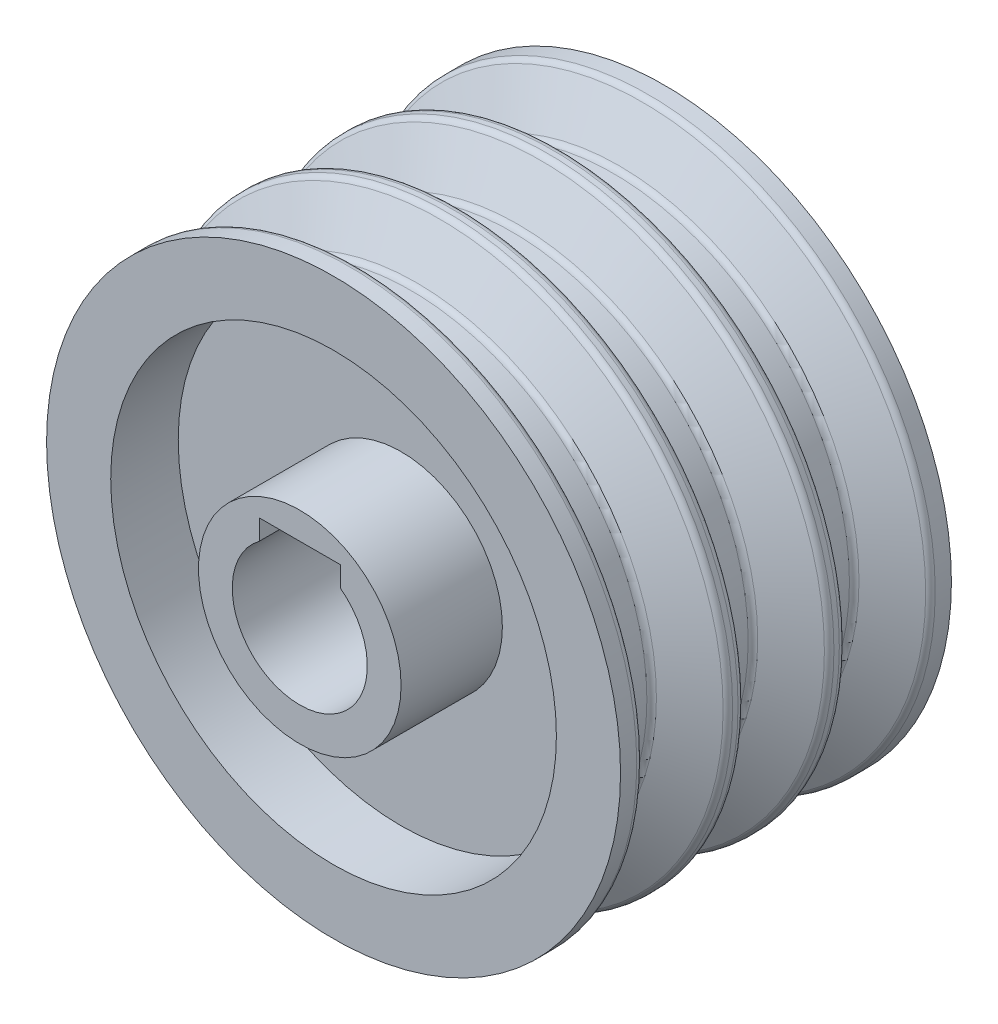
ISO-10303-21;
HEADER;
FILE_DESCRIPTION(('STEP AP214'),'2;1');
FILE_NAME('part.step','',(''),(''),'','','');
FILE_SCHEMA(('AUTOMOTIVE_DESIGN { 1 0 10303 214 1 1 1 1 }'));
ENDSEC;
DATA;
#1=APPLICATION_CONTEXT('core data for automotive mechanical design processes');
#2=APPLICATION_PROTOCOL_DEFINITION('international standard','automotive_design',2000,#1);
#3=PRODUCT_CONTEXT('',#1,'mechanical');
#4=PRODUCT('Part','Part','',(#3));
#5=PRODUCT_RELATED_PRODUCT_CATEGORY('part','',(#4));
#6=PRODUCT_DEFINITION_FORMATION('','',#4);
#7=PRODUCT_DEFINITION_CONTEXT('part definition',#1,'design');
#8=PRODUCT_DEFINITION('design','',#6,#7);
#9=PRODUCT_DEFINITION_SHAPE('','',#8);
#10=(LENGTH_UNIT() NAMED_UNIT(*) SI_UNIT(.MILLI.,.METRE.));
#11=(NAMED_UNIT(*) PLANE_ANGLE_UNIT() SI_UNIT($,.RADIAN.));
#12=(NAMED_UNIT(*) SI_UNIT($,.STERADIAN.) SOLID_ANGLE_UNIT());
#13=UNCERTAINTY_MEASURE_WITH_UNIT(LENGTH_MEASURE(1.E-05),#10,'distance_accuracy_value','');
#14=(GEOMETRIC_REPRESENTATION_CONTEXT(3) GLOBAL_UNCERTAINTY_ASSIGNED_CONTEXT((#13)) GLOBAL_UNIT_ASSIGNED_CONTEXT((#10,
#11,#12)) REPRESENTATION_CONTEXT('',''));
#15=CARTESIAN_POINT('',(0.,0.,0.));
#16=DIRECTION('',(0.,0.,1.));
#17=DIRECTION('',(1.,0.,0.));
#18=AXIS2_PLACEMENT_3D('',#15,#16,#17);
#19=CARTESIAN_POINT('',(0.,0.,24.5));
#20=DIRECTION('',(0.,0.,-1.));
#21=DIRECTION('',(-1.,0.,0.));
#22=AXIS2_PLACEMENT_3D('',#19,#20,#21);
#23=CYLINDRICAL_SURFACE('',#22,42.5);
#24=CARTESIAN_POINT('',(0.,0.,22.1));
#25=DIRECTION('',(0.,0.,-1.));
#26=DIRECTION('',(-1.,0.,0.));
#27=AXIS2_PLACEMENT_3D('',#24,#25,#26);
#28=CIRCLE('',#27,42.5);
#29=CARTESIAN_POINT('',(-42.5,0.,22.1));
#30=VERTEX_POINT('',#29);
#31=EDGE_CURVE('E202',#30,#30,#28,.F.);
#32=ORIENTED_EDGE('',*,*,#31,.T.);
#33=EDGE_LOOP('',(#32));
#34=FACE_BOUND('',#33,.T.);
#35=CARTESIAN_POINT('',(0.,0.,24.5));
#36=DIRECTION('',(0.,0.,1.));
#37=DIRECTION('',(1.,0.,0.));
#38=AXIS2_PLACEMENT_3D('',#35,#36,#37);
#39=CIRCLE('',#38,42.5);
#40=CARTESIAN_POINT('',(42.5,0.,24.5));
#41=VERTEX_POINT('',#40);
#42=EDGE_CURVE('E134',#41,#41,#39,.T.);
#43=ORIENTED_EDGE('',*,*,#42,.F.);
#44=EDGE_LOOP('',(#43));
#45=FACE_BOUND('',#44,.T.);
#46=ADVANCED_FACE('F35',(#34,#45),#23,.T.);
#47=CARTESIAN_POINT('',(0.,0.,-22.1000000000001));
#48=DIRECTION('',(0.,0.,-1.));
#49=DIRECTION('',(-1.,0.,0.));
#50=AXIS2_PLACEMENT_3D('',#47,#48,#49);
#51=CIRCLE('',#50,42.5);
#52=CARTESIAN_POINT('',(-42.5,0.,-22.1000000000001));
#53=VERTEX_POINT('',#52);
#54=EDGE_CURVE('E151',#53,#53,#51,.T.);
#55=ORIENTED_EDGE('',*,*,#54,.T.);
#56=EDGE_LOOP('',(#55));
#57=FACE_BOUND('',#56,.T.);
#58=CARTESIAN_POINT('',(0.,0.,-24.5));
#59=DIRECTION('',(0.,0.,1.));
#60=DIRECTION('',(1.,0.,0.));
#61=AXIS2_PLACEMENT_3D('',#58,#59,#60);
#62=CIRCLE('',#61,42.5);
#63=CARTESIAN_POINT('',(42.5,0.,-24.5));
#64=VERTEX_POINT('',#63);
#65=EDGE_CURVE('E135',#64,#64,#62,.T.);
#66=ORIENTED_EDGE('',*,*,#65,.T.);
#67=EDGE_LOOP('',(#66));
#68=FACE_BOUND('',#67,.T.);
#69=ADVANCED_FACE('F238',(#57,#68),#23,.T.);
#70=CARTESIAN_POINT('',(0.,0.,24.5));
#71=DIRECTION('',(0.,0.,-1.));
#72=DIRECTION('',(-1.,0.,0.));
#73=AXIS2_PLACEMENT_3D('',#70,#71,#72);
#74=CYLINDRICAL_SURFACE('',#73,33.);
#75=CARTESIAN_POINT('',(0.,0.,-24.5));
#76=DIRECTION('',(0.,0.,1.));
#77=DIRECTION('',(1.,0.,0.));
#78=AXIS2_PLACEMENT_3D('',#75,#76,#77);
#79=CIRCLE('',#78,33.);
#80=CARTESIAN_POINT('',(33.,0.,-24.5));
#81=VERTEX_POINT('',#80);
#82=EDGE_CURVE('E128',#81,#81,#79,.T.);
#83=ORIENTED_EDGE('',*,*,#82,.F.);
#84=EDGE_LOOP('',(#83));
#85=FACE_BOUND('',#84,.T.);
#86=CARTESIAN_POINT('',(0.,0.,-14.5));
#87=DIRECTION('',(0.,0.,1.));
#88=DIRECTION('',(1.,0.,0.));
#89=AXIS2_PLACEMENT_3D('',#86,#87,#88);
#90=CIRCLE('',#89,33.);
#91=CARTESIAN_POINT('',(33.,0.,-14.5));
#92=VERTEX_POINT('',#91);
#93=EDGE_CURVE('E124',#92,#92,#90,.T.);
#94=ORIENTED_EDGE('',*,*,#93,.T.);
#95=EDGE_LOOP('',(#94));
#96=FACE_BOUND('',#95,.T.);
#97=ADVANCED_FACE('F244',(#85,#96),#74,.F.);
#98=CARTESIAN_POINT('',(0.,0.,14.5));
#99=DIRECTION('',(0.,0.,1.));
#100=DIRECTION('',(1.,0.,0.));
#101=AXIS2_PLACEMENT_3D('',#98,#99,#100);
#102=CIRCLE('',#101,33.);
#103=CARTESIAN_POINT('',(33.,0.,14.5));
#104=VERTEX_POINT('',#103);
#105=EDGE_CURVE('E138',#104,#104,#102,.T.);
#106=ORIENTED_EDGE('',*,*,#105,.F.);
#107=EDGE_LOOP('',(#106));
#108=FACE_BOUND('',#107,.T.);
#109=CARTESIAN_POINT('',(0.,0.,24.5));
#110=DIRECTION('',(0.,0.,1.));
#111=DIRECTION('',(1.,0.,0.));
#112=AXIS2_PLACEMENT_3D('',#109,#110,#111);
#113=CIRCLE('',#112,33.);
#114=CARTESIAN_POINT('',(33.,0.,24.5));
#115=VERTEX_POINT('',#114);
#116=EDGE_CURVE('E131',#115,#115,#113,.T.);
#117=ORIENTED_EDGE('',*,*,#116,.T.);
#118=EDGE_LOOP('',(#117));
#119=FACE_BOUND('',#118,.T.);
#120=ADVANCED_FACE('F251',(#108,#119),#74,.F.);
#121=CARTESIAN_POINT('',(0.,0.,24.5));
#122=DIRECTION('',(0.,0.,1.));
#123=DIRECTION('',(1.,0.,0.));
#124=AXIS2_PLACEMENT_3D('',#121,#122,#123);
#125=PLANE('',#124);
#126=ORIENTED_EDGE('',*,*,#116,.F.);
#127=EDGE_LOOP('',(#126));
#128=FACE_BOUND('',#127,.T.);
#129=ORIENTED_EDGE('',*,*,#42,.T.);
#130=EDGE_LOOP('',(#129));
#131=FACE_BOUND('',#130,.T.);
#132=ADVANCED_FACE('F254',(#128,#131),#125,.T.);
#133=CARTESIAN_POINT('',(0.,0.,-24.5));
#134=DIRECTION('',(0.,0.,1.));
#135=DIRECTION('',(1.,0.,0.));
#136=AXIS2_PLACEMENT_3D('',#133,#134,#135);
#137=PLANE('',#136);
#138=ORIENTED_EDGE('',*,*,#82,.T.);
#139=EDGE_LOOP('',(#138));
#140=FACE_BOUND('',#139,.T.);
#141=ORIENTED_EDGE('',*,*,#65,.F.);
#142=EDGE_LOOP('',(#141));
#143=FACE_BOUND('',#142,.T.);
#144=ADVANCED_FACE('F249',(#140,#143),#137,.F.);
#145=CARTESIAN_POINT('',(0.,0.,14.5));
#146=DIRECTION('',(0.,0.,1.));
#147=DIRECTION('',(1.,0.,0.));
#148=AXIS2_PLACEMENT_3D('',#145,#146,#147);
#149=PLANE('',#148);
#150=CARTESIAN_POINT('',(0.,0.,14.5));
#151=DIRECTION('',(0.,0.,1.));
#152=DIRECTION('',(1.,0.,0.));
#153=AXIS2_PLACEMENT_3D('',#150,#151,#152);
#154=CIRCLE('',#153,15.);
#155=CARTESIAN_POINT('',(15.,0.,14.5));
#156=VERTEX_POINT('',#155);
#157=EDGE_CURVE('E125',#156,#156,#154,.T.);
#158=ORIENTED_EDGE('',*,*,#157,.F.);
#159=EDGE_LOOP('',(#158));
#160=FACE_BOUND('',#159,.T.);
#161=ORIENTED_EDGE('',*,*,#105,.T.);
#162=EDGE_LOOP('',(#161));
#163=FACE_BOUND('',#162,.T.);
#164=ADVANCED_FACE('F478',(#160,#163),#149,.T.);
#165=CARTESIAN_POINT('',(0.,0.,-14.5));
#166=DIRECTION('',(0.,0.,1.));
#167=DIRECTION('',(1.,0.,0.));
#168=AXIS2_PLACEMENT_3D('',#165,#166,#167);
#169=PLANE('',#168);
#170=CARTESIAN_POINT('',(0.,0.,-14.5));
#171=DIRECTION('',(0.,0.,1.));
#172=DIRECTION('',(1.,0.,0.));
#173=AXIS2_PLACEMENT_3D('',#170,#171,#172);
#174=CIRCLE('',#173,15.);
#175=CARTESIAN_POINT('',(15.,0.,-14.5));
#176=VERTEX_POINT('',#175);
#177=EDGE_CURVE('E121',#176,#176,#174,.F.);
#178=ORIENTED_EDGE('',*,*,#177,.F.);
#179=EDGE_LOOP('',(#178));
#180=FACE_BOUND('',#179,.T.);
#181=ORIENTED_EDGE('',*,*,#93,.F.);
#182=EDGE_LOOP('',(#181));
#183=FACE_BOUND('',#182,.T.);
#184=ADVANCED_FACE('F471',(#180,#183),#169,.F.);
#185=CARTESIAN_POINT('',(0.,0.,29.5));
#186=DIRECTION('',(0.,0.,-1.));
#187=DIRECTION('',(-1.,0.,0.));
#188=AXIS2_PLACEMENT_3D('',#185,#186,#187);
#189=CYLINDRICAL_SURFACE('',#188,15.);
#190=CARTESIAN_POINT('',(0.,0.,-29.5));
#191=DIRECTION('',(0.,0.,1.));
#192=DIRECTION('',(1.,0.,0.));
#193=AXIS2_PLACEMENT_3D('',#190,#191,#192);
#194=CIRCLE('',#193,15.);
#195=CARTESIAN_POINT('',(15.,0.,-29.5));
#196=VERTEX_POINT('',#195);
#197=EDGE_CURVE('E115',#196,#196,#194,.T.);
#198=ORIENTED_EDGE('',*,*,#197,.T.);
#199=EDGE_LOOP('',(#198));
#200=FACE_BOUND('',#199,.T.);
#201=ORIENTED_EDGE('',*,*,#177,.T.);
#202=EDGE_LOOP('',(#201));
#203=FACE_BOUND('',#202,.T.);
#204=ADVANCED_FACE('F477',(#200,#203),#189,.T.);
#205=CARTESIAN_POINT('',(6.,0.,29.5));
#206=DIRECTION('',(1.,0.,0.));
#207=DIRECTION('',(0.,1.,0.));
#208=AXIS2_PLACEMENT_3D('',#205,#206,#207);
#209=PLANE('',#208);
#210=DIRECTION('',(0.,-1.,0.));
#211=VECTOR('',#210,1.);
#212=CARTESIAN_POINT('',(6.,0.,-29.5));
#213=LINE('',#212,#211);
#214=CARTESIAN_POINT('',(5.99999999999992,11.,-29.5));
#215=VERTEX_POINT('',#214);
#216=CARTESIAN_POINT('',(5.99999999999994,8.,-29.5));
#217=VERTEX_POINT('',#216);
#218=EDGE_CURVE('E107',#215,#217,#213,.T.);
#219=ORIENTED_EDGE('',*,*,#218,.T.);
#220=DIRECTION('',(0.,0.,-1.));
#221=VECTOR('',#220,1.);
#222=CARTESIAN_POINT('',(5.99999999999994,8.,29.5));
#223=LINE('',#222,#221);
#224=CARTESIAN_POINT('',(5.99999999999994,8.,29.5));
#225=VERTEX_POINT('',#224);
#226=EDGE_CURVE('E91',#225,#217,#223,.T.);
#227=ORIENTED_EDGE('',*,*,#226,.F.);
#228=DIRECTION('',(0.,-1.,0.));
#229=VECTOR('',#228,1.);
#230=CARTESIAN_POINT('',(6.,0.,29.5));
#231=LINE('',#230,#229);
#232=CARTESIAN_POINT('',(5.99999999999992,11.,29.5));
#233=VERTEX_POINT('',#232);
#234=EDGE_CURVE('E77',#233,#225,#231,.T.);
#235=ORIENTED_EDGE('',*,*,#234,.F.);
#236=DIRECTION('',(0.,0.,-1.));
#237=VECTOR('',#236,1.);
#238=CARTESIAN_POINT('',(5.99999999999992,11.,29.5));
#239=LINE('',#238,#237);
#240=EDGE_CURVE('E52',#233,#215,#239,.T.);
#241=ORIENTED_EDGE('',*,*,#240,.T.);
#242=EDGE_LOOP('',(#219,#227,#235,#241));
#243=FACE_BOUND('',#242,.T.);
#244=ADVANCED_FACE('F495',(#243),#209,.F.);
#245=CARTESIAN_POINT('',(0.,0.,29.5));
#246=DIRECTION('',(0.,0.,-1.));
#247=DIRECTION('',(-1.,0.,0.));
#248=AXIS2_PLACEMENT_3D('',#245,#246,#247);
#249=CYLINDRICAL_SURFACE('',#248,9.99999999999998);
#250=CARTESIAN_POINT('',(0.,0.,-29.5));
#251=DIRECTION('',(0.,0.,1.));
#252=DIRECTION('',(1.,0.,0.));
#253=AXIS2_PLACEMENT_3D('',#250,#251,#252);
#254=CIRCLE('',#253,9.99999999999998);
#255=CARTESIAN_POINT('',(-6.,8.,-29.5));
#256=VERTEX_POINT('',#255);
#257=EDGE_CURVE('E87',#256,#217,#254,.T.);
#258=ORIENTED_EDGE('',*,*,#257,.F.);
#259=DIRECTION('',(0.,0.,-1.));
#260=VECTOR('',#259,1.);
#261=CARTESIAN_POINT('',(-6.,8.,29.5));
#262=LINE('',#261,#260);
#263=CARTESIAN_POINT('',(-6.,8.,29.5));
#264=VERTEX_POINT('',#263);
#265=EDGE_CURVE('E83',#264,#256,#262,.T.);
#266=ORIENTED_EDGE('',*,*,#265,.F.);
#267=CARTESIAN_POINT('',(0.,0.,29.5));
#268=DIRECTION('',(0.,0.,1.));
#269=DIRECTION('',(1.,0.,0.));
#270=AXIS2_PLACEMENT_3D('',#267,#268,#269);
#271=CIRCLE('',#270,9.99999999999998);
#272=EDGE_CURVE('E85',#264,#225,#271,.T.);
#273=ORIENTED_EDGE('',*,*,#272,.T.);
#274=ORIENTED_EDGE('',*,*,#226,.T.);
#275=EDGE_LOOP('',(#258,#266,#273,#274));
#276=FACE_BOUND('',#275,.T.);
#277=ADVANCED_FACE('F84',(#276),#249,.F.);
#278=CARTESIAN_POINT('',(-6.,0.,29.5));
#279=DIRECTION('',(1.,0.,0.));
#280=DIRECTION('',(0.,0.,-1.));
#281=AXIS2_PLACEMENT_3D('',#278,#279,#280);
#282=PLANE('',#281);
#283=DIRECTION('',(0.,-1.,0.));
#284=VECTOR('',#283,1.);
#285=CARTESIAN_POINT('',(-6.,0.,-29.5));
#286=LINE('',#285,#284);
#287=CARTESIAN_POINT('',(-6.,11.,-29.5));
#288=VERTEX_POINT('',#287);
#289=EDGE_CURVE('E110',#288,#256,#286,.T.);
#290=ORIENTED_EDGE('',*,*,#289,.F.);
#291=DIRECTION('',(0.,0.,-1.));
#292=VECTOR('',#291,1.);
#293=CARTESIAN_POINT('',(-6.,11.,29.5));
#294=LINE('',#293,#292);
#295=CARTESIAN_POINT('',(-6.,11.,29.5));
#296=VERTEX_POINT('',#295);
#297=EDGE_CURVE('E66',#296,#288,#294,.T.);
#298=ORIENTED_EDGE('',*,*,#297,.F.);
#299=DIRECTION('',(0.,-1.,0.));
#300=VECTOR('',#299,1.);
#301=CARTESIAN_POINT('',(-6.,0.,29.5));
#302=LINE('',#301,#300);
#303=EDGE_CURVE('E96',#296,#264,#302,.T.);
#304=ORIENTED_EDGE('',*,*,#303,.T.);
#305=ORIENTED_EDGE('',*,*,#265,.T.);
#306=EDGE_LOOP('',(#290,#298,#304,#305));
#307=FACE_BOUND('',#306,.T.);
#308=ADVANCED_FACE('F98',(#307),#282,.T.);
#309=CARTESIAN_POINT('',(0.,11.,29.5));
#310=DIRECTION('',(0.,-1.,0.));
#311=DIRECTION('',(0.,0.,-1.));
#312=AXIS2_PLACEMENT_3D('',#309,#310,#311);
#313=PLANE('',#312);
#314=DIRECTION('',(-1.,0.,0.));
#315=VECTOR('',#314,1.);
#316=CARTESIAN_POINT('',(0.,11.,-29.5));
#317=LINE('',#316,#315);
#318=EDGE_CURVE('E112',#215,#288,#317,.T.);
#319=ORIENTED_EDGE('',*,*,#318,.F.);
#320=ORIENTED_EDGE('',*,*,#240,.F.);
#321=DIRECTION('',(-1.,0.,0.));
#322=VECTOR('',#321,1.);
#323=CARTESIAN_POINT('',(0.,11.,29.5));
#324=LINE('',#323,#322);
#325=EDGE_CURVE('E99',#233,#296,#324,.T.);
#326=ORIENTED_EDGE('',*,*,#325,.T.);
#327=ORIENTED_EDGE('',*,*,#297,.T.);
#328=EDGE_LOOP('',(#319,#320,#326,#327));
#329=FACE_BOUND('',#328,.T.);
#330=ADVANCED_FACE('F523',(#329),#313,.T.);
#331=ORIENTED_EDGE('',*,*,#157,.T.);
#332=EDGE_LOOP('',(#331));
#333=FACE_BOUND('',#332,.T.);
#334=CARTESIAN_POINT('',(0.,0.,29.5));
#335=DIRECTION('',(0.,0.,1.));
#336=DIRECTION('',(1.,0.,0.));
#337=AXIS2_PLACEMENT_3D('',#334,#335,#336);
#338=CIRCLE('',#337,15.);
#339=CARTESIAN_POINT('',(15.,0.,29.5));
#340=VERTEX_POINT('',#339);
#341=EDGE_CURVE('E101',#340,#340,#338,.T.);
#342=ORIENTED_EDGE('',*,*,#341,.F.);
#343=EDGE_LOOP('',(#342));
#344=FACE_BOUND('',#343,.T.);
#345=ADVANCED_FACE('F498',(#333,#344),#189,.T.);
#346=CARTESIAN_POINT('',(0.,0.,29.5));
#347=DIRECTION('',(0.,0.,1.));
#348=DIRECTION('',(1.,0.,0.));
#349=AXIS2_PLACEMENT_3D('',#346,#347,#348);
#350=PLANE('',#349);
#351=ORIENTED_EDGE('',*,*,#234,.T.);
#352=ORIENTED_EDGE('',*,*,#272,.F.);
#353=ORIENTED_EDGE('',*,*,#303,.F.);
#354=ORIENTED_EDGE('',*,*,#325,.F.);
#355=EDGE_LOOP('',(#351,#352,#353,#354));
#356=FACE_BOUND('',#355,.T.);
#357=ORIENTED_EDGE('',*,*,#341,.T.);
#358=EDGE_LOOP('',(#357));
#359=FACE_BOUND('',#358,.T.);
#360=ADVANCED_FACE('F94',(#356,#359),#350,.T.);
#361=CARTESIAN_POINT('',(0.,0.,-29.5));
#362=DIRECTION('',(0.,0.,1.));
#363=DIRECTION('',(1.,0.,0.));
#364=AXIS2_PLACEMENT_3D('',#361,#362,#363);
#365=PLANE('',#364);
#366=ORIENTED_EDGE('',*,*,#218,.F.);
#367=ORIENTED_EDGE('',*,*,#318,.T.);
#368=ORIENTED_EDGE('',*,*,#289,.T.);
#369=ORIENTED_EDGE('',*,*,#257,.T.);
#370=EDGE_LOOP('',(#366,#367,#368,#369));
#371=FACE_BOUND('',#370,.T.);
#372=ORIENTED_EDGE('',*,*,#197,.F.);
#373=EDGE_LOOP('',(#372));
#374=FACE_BOUND('',#373,.T.);
#375=ADVANCED_FACE('F446',(#371,#374),#365,.F.);
#376=CARTESIAN_POINT('',(0.,0.,-8.49999999999995));
#377=DIRECTION('',(0.,0.,1.));
#378=DIRECTION('',(1.,0.,0.));
#379=AXIS2_PLACEMENT_3D('',#376,#377,#378);
#380=CONICAL_SURFACE('',#379,42.5,1.08083900054117);
#381=CARTESIAN_POINT('',(0.,0.,-12.2176470588235));
#382=DIRECTION('',(0.,0.,1.));
#383=DIRECTION('',(1.,0.,0.));
#384=AXIS2_PLACEMENT_3D('',#381,#382,#383);
#385=CIRCLE('',#384,35.5294117647059);
#386=CARTESIAN_POINT('',(35.5294117647059,0.,-12.2176470588235));
#387=VERTEX_POINT('',#386);
#388=EDGE_CURVE('E163',#387,#387,#385,.T.);
#389=ORIENTED_EDGE('',*,*,#388,.T.);
#390=EDGE_LOOP('',(#389));
#391=FACE_BOUND('',#390,.T.);
#392=CARTESIAN_POINT('',(0.,0.,-8.78235294117641));
#393=DIRECTION('',(0.,0.,1.));
#394=DIRECTION('',(1.,0.,0.));
#395=AXIS2_PLACEMENT_3D('',#392,#393,#394);
#396=CIRCLE('',#395,41.9705882352941);
#397=CARTESIAN_POINT('',(41.9705882352941,0.,-8.78235294117641));
#398=VERTEX_POINT('',#397);
#399=EDGE_CURVE('E160',#398,#398,#396,.F.);
#400=ORIENTED_EDGE('',*,*,#399,.T.);
#401=EDGE_LOOP('',(#400));
#402=FACE_BOUND('',#401,.T.);
#403=ADVANCED_FACE('F437',(#391,#402),#380,.T.);
#404=CARTESIAN_POINT('',(0.,0.,1000.));
#405=DIRECTION('',(0.,0.,1.));
#406=DIRECTION('',(1.,0.,0.));
#407=AXIS2_PLACEMENT_3D('',#404,#405,#406);
#408=CYLINDRICAL_SURFACE('',#407,35.);
#409=CARTESIAN_POINT('',(0.,0.,-16.9000000000001));
#410=DIRECTION('',(0.,0.,1.));
#411=DIRECTION('',(1.,0.,0.));
#412=AXIS2_PLACEMENT_3D('',#409,#410,#411);
#413=CIRCLE('',#412,35.);
#414=CARTESIAN_POINT('',(35.,0.,-16.9000000000001));
#415=VERTEX_POINT('',#414);
#416=EDGE_CURVE('E157',#415,#415,#413,.T.);
#417=ORIENTED_EDGE('',*,*,#416,.T.);
#418=EDGE_LOOP('',(#417));
#419=FACE_BOUND('',#418,.T.);
#420=CARTESIAN_POINT('',(0.,0.,-13.0999999999999));
#421=DIRECTION('',(0.,0.,1.));
#422=DIRECTION('',(1.,0.,0.));
#423=AXIS2_PLACEMENT_3D('',#420,#421,#422);
#424=CIRCLE('',#423,35.);
#425=CARTESIAN_POINT('',(35.,0.,-13.0999999999999));
#426=VERTEX_POINT('',#425);
#427=EDGE_CURVE('E154',#426,#426,#424,.F.);
#428=ORIENTED_EDGE('',*,*,#427,.T.);
#429=EDGE_LOOP('',(#428));
#430=FACE_BOUND('',#429,.T.);
#431=ADVANCED_FACE('F428',(#419,#430),#408,.T.);
#432=CARTESIAN_POINT('',(0.,0.,-17.5000000000001));
#433=DIRECTION('',(0.,0.,-1.));
#434=DIRECTION('',(-1.,0.,0.));
#435=AXIS2_PLACEMENT_3D('',#432,#433,#434);
#436=CONICAL_SURFACE('',#435,35.,1.08083900054117);
#437=CARTESIAN_POINT('',(0.,0.,-21.2176470588236));
#438=DIRECTION('',(0.,0.,-1.));
#439=DIRECTION('',(-1.,0.,0.));
#440=AXIS2_PLACEMENT_3D('',#437,#438,#439);
#441=CIRCLE('',#440,41.9705882352941);
#442=CARTESIAN_POINT('',(-41.9705882352941,0.,-21.2176470588236));
#443=VERTEX_POINT('',#442);
#444=EDGE_CURVE('E148',#443,#443,#441,.F.);
#445=ORIENTED_EDGE('',*,*,#444,.T.);
#446=EDGE_LOOP('',(#445));
#447=FACE_BOUND('',#446,.T.);
#448=CARTESIAN_POINT('',(0.,0.,-17.7823529411766));
#449=DIRECTION('',(0.,0.,-1.));
#450=DIRECTION('',(-1.,0.,0.));
#451=AXIS2_PLACEMENT_3D('',#448,#449,#450);
#452=CIRCLE('',#451,35.5294117647059);
#453=CARTESIAN_POINT('',(-35.5294117647059,0.,-17.7823529411766));
#454=VERTEX_POINT('',#453);
#455=EDGE_CURVE('E145',#454,#454,#452,.T.);
#456=ORIENTED_EDGE('',*,*,#455,.T.);
#457=EDGE_LOOP('',(#456));
#458=FACE_BOUND('',#457,.T.);
#459=ADVANCED_FACE('F422',(#447,#458),#436,.T.);
#460=CARTESIAN_POINT('',(0.,0.,-7.89999999999996));
#461=DIRECTION('',(0.,0.,-1.));
#462=DIRECTION('',(-1.,0.,0.));
#463=AXIS2_PLACEMENT_3D('',#460,#461,#462);
#464=CIRCLE('',#463,42.5);
#465=CARTESIAN_POINT('',(-42.5,0.,-7.89999999999996));
#466=VERTEX_POINT('',#465);
#467=EDGE_CURVE('E169',#466,#466,#464,.F.);
#468=ORIENTED_EDGE('',*,*,#467,.T.);
#469=EDGE_LOOP('',(#468));
#470=FACE_BOUND('',#469,.T.);
#471=CARTESIAN_POINT('',(0.,0.,-7.09999999999995));
#472=DIRECTION('',(0.,0.,-1.));
#473=DIRECTION('',(-1.,0.,0.));
#474=AXIS2_PLACEMENT_3D('',#471,#472,#473);
#475=CIRCLE('',#474,42.5);
#476=CARTESIAN_POINT('',(-42.5,0.,-7.09999999999995));
#477=VERTEX_POINT('',#476);
#478=EDGE_CURVE('E166',#477,#477,#475,.T.);
#479=ORIENTED_EDGE('',*,*,#478,.T.);
#480=EDGE_LOOP('',(#479));
#481=FACE_BOUND('',#480,.T.);
#482=ADVANCED_FACE('F235',(#470,#481),#23,.T.);
#483=CARTESIAN_POINT('',(0.,0.,6.49999999999995));
#484=DIRECTION('',(0.,0.,1.));
#485=DIRECTION('',(1.,0.,0.));
#486=AXIS2_PLACEMENT_3D('',#483,#484,#485);
#487=CONICAL_SURFACE('',#486,42.5,1.08083900054117);
#488=CARTESIAN_POINT('',(0.,0.,2.78235294117642));
#489=DIRECTION('',(0.,0.,1.));
#490=DIRECTION('',(1.,0.,0.));
#491=AXIS2_PLACEMENT_3D('',#488,#489,#490);
#492=CIRCLE('',#491,35.5294117647059);
#493=CARTESIAN_POINT('',(35.5294117647059,0.,2.78235294117642));
#494=VERTEX_POINT('',#493);
#495=EDGE_CURVE('E187',#494,#494,#492,.T.);
#496=ORIENTED_EDGE('',*,*,#495,.T.);
#497=EDGE_LOOP('',(#496));
#498=FACE_BOUND('',#497,.T.);
#499=CARTESIAN_POINT('',(0.,0.,6.21764705882349));
#500=DIRECTION('',(0.,0.,1.));
#501=DIRECTION('',(1.,0.,0.));
#502=AXIS2_PLACEMENT_3D('',#499,#500,#501);
#503=CIRCLE('',#502,41.9705882352941);
#504=CARTESIAN_POINT('',(41.9705882352941,0.,6.21764705882349));
#505=VERTEX_POINT('',#504);
#506=EDGE_CURVE('E184',#505,#505,#503,.F.);
#507=ORIENTED_EDGE('',*,*,#506,.T.);
#508=EDGE_LOOP('',(#507));
#509=FACE_BOUND('',#508,.T.);
#510=ADVANCED_FACE('F409',(#498,#509),#487,.T.);
#511=CARTESIAN_POINT('',(0.,0.,1000.));
#512=DIRECTION('',(0.,0.,1.));
#513=DIRECTION('',(1.,0.,0.));
#514=AXIS2_PLACEMENT_3D('',#511,#512,#513);
#515=CYLINDRICAL_SURFACE('',#514,35.);
#516=CARTESIAN_POINT('',(0.,0.,-1.90000000000001));
#517=DIRECTION('',(0.,0.,1.));
#518=DIRECTION('',(1.,0.,0.));
#519=AXIS2_PLACEMENT_3D('',#516,#517,#518);
#520=CIRCLE('',#519,35.);
#521=CARTESIAN_POINT('',(35.,0.,-1.90000000000001));
#522=VERTEX_POINT('',#521);
#523=EDGE_CURVE('E181',#522,#522,#520,.T.);
#524=ORIENTED_EDGE('',*,*,#523,.T.);
#525=EDGE_LOOP('',(#524));
#526=FACE_BOUND('',#525,.T.);
#527=CARTESIAN_POINT('',(0.,0.,1.8999999999999));
#528=DIRECTION('',(0.,0.,1.));
#529=DIRECTION('',(1.,0.,0.));
#530=AXIS2_PLACEMENT_3D('',#527,#528,#529);
#531=CIRCLE('',#530,35.);
#532=CARTESIAN_POINT('',(35.,0.,1.8999999999999));
#533=VERTEX_POINT('',#532);
#534=EDGE_CURVE('E178',#533,#533,#531,.F.);
#535=ORIENTED_EDGE('',*,*,#534,.T.);
#536=EDGE_LOOP('',(#535));
#537=FACE_BOUND('',#536,.T.);
#538=ADVANCED_FACE('F401',(#526,#537),#515,.T.);
#539=CARTESIAN_POINT('',(0.,0.,-2.49999999999995));
#540=DIRECTION('',(0.,0.,-1.));
#541=DIRECTION('',(-1.,0.,0.));
#542=AXIS2_PLACEMENT_3D('',#539,#540,#541);
#543=CONICAL_SURFACE('',#542,35.,1.08083900054117);
#544=CARTESIAN_POINT('',(0.,0.,-6.21764705882348));
#545=DIRECTION('',(0.,0.,-1.));
#546=DIRECTION('',(-1.,0.,0.));
#547=AXIS2_PLACEMENT_3D('',#544,#545,#546);
#548=CIRCLE('',#547,41.9705882352941);
#549=CARTESIAN_POINT('',(-41.9705882352941,0.,-6.21764705882348));
#550=VERTEX_POINT('',#549);
#551=EDGE_CURVE('E175',#550,#550,#548,.F.);
#552=ORIENTED_EDGE('',*,*,#551,.T.);
#553=EDGE_LOOP('',(#552));
#554=FACE_BOUND('',#553,.T.);
#555=CARTESIAN_POINT('',(0.,0.,-2.78235294117644));
#556=DIRECTION('',(0.,0.,-1.));
#557=DIRECTION('',(-1.,0.,0.));
#558=AXIS2_PLACEMENT_3D('',#555,#556,#557);
#559=CIRCLE('',#558,35.5294117647059);
#560=CARTESIAN_POINT('',(-35.5294117647059,0.,-2.78235294117644));
#561=VERTEX_POINT('',#560);
#562=EDGE_CURVE('E172',#561,#561,#559,.T.);
#563=ORIENTED_EDGE('',*,*,#562,.T.);
#564=EDGE_LOOP('',(#563));
#565=FACE_BOUND('',#564,.T.);
#566=ADVANCED_FACE('F232',(#554,#565),#543,.T.);
#567=CARTESIAN_POINT('',(0.,0.,7.09999999999995));
#568=DIRECTION('',(0.,0.,-1.));
#569=DIRECTION('',(-1.,0.,0.));
#570=AXIS2_PLACEMENT_3D('',#567,#568,#569);
#571=CIRCLE('',#570,42.5);
#572=CARTESIAN_POINT('',(-42.5,0.,7.09999999999995));
#573=VERTEX_POINT('',#572);
#574=EDGE_CURVE('E193',#573,#573,#571,.F.);
#575=ORIENTED_EDGE('',*,*,#574,.T.);
#576=EDGE_LOOP('',(#575));
#577=FACE_BOUND('',#576,.T.);
#578=CARTESIAN_POINT('',(0.,0.,7.89999999999995));
#579=DIRECTION('',(0.,0.,-1.));
#580=DIRECTION('',(-1.,0.,0.));
#581=AXIS2_PLACEMENT_3D('',#578,#579,#580);
#582=CIRCLE('',#581,42.5);
#583=CARTESIAN_POINT('',(-42.5,0.,7.89999999999995));
#584=VERTEX_POINT('',#583);
#585=EDGE_CURVE('E190',#584,#584,#582,.T.);
#586=ORIENTED_EDGE('',*,*,#585,.T.);
#587=EDGE_LOOP('',(#586));
#588=FACE_BOUND('',#587,.T.);
#589=ADVANCED_FACE('F222',(#577,#588),#23,.T.);
#590=CARTESIAN_POINT('',(0.,0.,21.5));
#591=DIRECTION('',(0.,0.,1.));
#592=DIRECTION('',(1.,0.,0.));
#593=AXIS2_PLACEMENT_3D('',#590,#591,#592);
#594=CONICAL_SURFACE('',#593,42.5,1.08083900054117);
#595=CARTESIAN_POINT('',(0.,0.,21.2176470588235));
#596=DIRECTION('',(0.,0.,1.));
#597=DIRECTION('',(1.,0.,0.));
#598=AXIS2_PLACEMENT_3D('',#595,#596,#597);
#599=CIRCLE('',#598,41.9705882352941);
#600=CARTESIAN_POINT('',(41.9705882352941,0.,21.2176470588235));
#601=VERTEX_POINT('',#600);
#602=EDGE_CURVE('E208',#601,#601,#599,.F.);
#603=ORIENTED_EDGE('',*,*,#602,.T.);
#604=EDGE_LOOP('',(#603));
#605=FACE_BOUND('',#604,.T.);
#606=CARTESIAN_POINT('',(0.,0.,17.7823529411764));
#607=DIRECTION('',(0.,0.,1.));
#608=DIRECTION('',(1.,0.,0.));
#609=AXIS2_PLACEMENT_3D('',#606,#607,#608);
#610=CIRCLE('',#609,35.5294117647059);
#611=CARTESIAN_POINT('',(35.5294117647059,0.,17.7823529411764));
#612=VERTEX_POINT('',#611);
#613=EDGE_CURVE('E205',#612,#612,#610,.T.);
#614=ORIENTED_EDGE('',*,*,#613,.T.);
#615=EDGE_LOOP('',(#614));
#616=FACE_BOUND('',#615,.T.);
#617=ADVANCED_FACE('F220',(#605,#616),#594,.T.);
#618=CARTESIAN_POINT('',(0.,0.,1000.));
#619=DIRECTION('',(0.,0.,1.));
#620=DIRECTION('',(1.,0.,0.));
#621=AXIS2_PLACEMENT_3D('',#618,#619,#620);
#622=CYLINDRICAL_SURFACE('',#621,35.);
#623=CARTESIAN_POINT('',(0.,0.,13.1));
#624=DIRECTION('',(0.,0.,1.));
#625=DIRECTION('',(1.,0.,0.));
#626=AXIS2_PLACEMENT_3D('',#623,#624,#625);
#627=CIRCLE('',#626,35.);
#628=CARTESIAN_POINT('',(35.,0.,13.1));
#629=VERTEX_POINT('',#628);
#630=EDGE_CURVE('E11',#629,#629,#627,.T.);
#631=ORIENTED_EDGE('',*,*,#630,.T.);
#632=EDGE_LOOP('',(#631));
#633=FACE_BOUND('',#632,.T.);
#634=CARTESIAN_POINT('',(0.,0.,16.8999999999999));
#635=DIRECTION('',(0.,0.,1.));
#636=DIRECTION('',(1.,0.,0.));
#637=AXIS2_PLACEMENT_3D('',#634,#635,#636);
#638=CIRCLE('',#637,35.);
#639=CARTESIAN_POINT('',(35.,0.,16.8999999999999));
#640=VERTEX_POINT('',#639);
#641=EDGE_CURVE('E44',#640,#640,#638,.F.);
#642=ORIENTED_EDGE('',*,*,#641,.T.);
#643=EDGE_LOOP('',(#642));
#644=FACE_BOUND('',#643,.T.);
#645=ADVANCED_FACE('F213',(#633,#644),#622,.T.);
#646=CARTESIAN_POINT('',(0.,0.,12.5));
#647=DIRECTION('',(0.,0.,-1.));
#648=DIRECTION('',(-1.,0.,0.));
#649=AXIS2_PLACEMENT_3D('',#646,#647,#648);
#650=CONICAL_SURFACE('',#649,35.,1.08083900054117);
#651=CARTESIAN_POINT('',(0.,0.,8.78235294117641));
#652=DIRECTION('',(0.,0.,-1.));
#653=DIRECTION('',(-1.,0.,0.));
#654=AXIS2_PLACEMENT_3D('',#651,#652,#653);
#655=CIRCLE('',#654,41.9705882352941);
#656=CARTESIAN_POINT('',(-41.9705882352941,0.,8.78235294117641));
#657=VERTEX_POINT('',#656);
#658=EDGE_CURVE('E199',#657,#657,#655,.F.);
#659=ORIENTED_EDGE('',*,*,#658,.T.);
#660=EDGE_LOOP('',(#659));
#661=FACE_BOUND('',#660,.T.);
#662=CARTESIAN_POINT('',(0.,0.,12.2176470588235));
#663=DIRECTION('',(0.,0.,-1.));
#664=DIRECTION('',(-1.,0.,0.));
#665=AXIS2_PLACEMENT_3D('',#662,#663,#664);
#666=CIRCLE('',#665,35.5294117647059);
#667=CARTESIAN_POINT('',(-35.5294117647059,0.,12.2176470588235));
#668=VERTEX_POINT('',#667);
#669=EDGE_CURVE('E196',#668,#668,#666,.T.);
#670=ORIENTED_EDGE('',*,*,#669,.T.);
#671=EDGE_LOOP('',(#670));
#672=FACE_BOUND('',#671,.T.);
#673=ADVANCED_FACE('F229',(#661,#672),#650,.T.);
#674=CARTESIAN_POINT('',(0.,0.,-22.1000000000001));
#675=DIRECTION('',(0.,0.,-1.));
#676=DIRECTION('',(-1.,0.,0.));
#677=AXIS2_PLACEMENT_3D('',#674,#675,#676);
#678=TOROIDAL_SURFACE('',#677,41.5,1.);
#679=ORIENTED_EDGE('',*,*,#54,.F.);
#680=EDGE_LOOP('',(#679));
#681=FACE_BOUND('',#680,.T.);
#682=ORIENTED_EDGE('',*,*,#444,.F.);
#683=EDGE_LOOP('',(#682));
#684=FACE_BOUND('',#683,.T.);
#685=ADVANCED_FACE('F256',(#681,#684),#678,.T.);
#686=CARTESIAN_POINT('',(0.,0.,-16.9000000000001));
#687=DIRECTION('',(0.,0.,1.));
#688=DIRECTION('',(1.,0.,0.));
#689=AXIS2_PLACEMENT_3D('',#686,#687,#688);
#690=TOROIDAL_SURFACE('',#689,36.,1.);
#691=ORIENTED_EDGE('',*,*,#455,.F.);
#692=EDGE_LOOP('',(#691));
#693=FACE_BOUND('',#692,.T.);
#694=ORIENTED_EDGE('',*,*,#416,.F.);
#695=EDGE_LOOP('',(#694));
#696=FACE_BOUND('',#695,.T.);
#697=ADVANCED_FACE('F259',(#693,#696),#690,.F.);
#698=CARTESIAN_POINT('',(0.,0.,-13.0999999999999));
#699=DIRECTION('',(0.,0.,1.));
#700=DIRECTION('',(1.,0.,0.));
#701=AXIS2_PLACEMENT_3D('',#698,#699,#700);
#702=TOROIDAL_SURFACE('',#701,36.,1.);
#703=ORIENTED_EDGE('',*,*,#427,.F.);
#704=EDGE_LOOP('',(#703));
#705=FACE_BOUND('',#704,.T.);
#706=ORIENTED_EDGE('',*,*,#388,.F.);
#707=EDGE_LOOP('',(#706));
#708=FACE_BOUND('',#707,.T.);
#709=ADVANCED_FACE('F263',(#705,#708),#702,.F.);
#710=CARTESIAN_POINT('',(0.,0.,-7.89999999999995));
#711=DIRECTION('',(0.,0.,-1.));
#712=DIRECTION('',(-1.,0.,0.));
#713=AXIS2_PLACEMENT_3D('',#710,#711,#712);
#714=TOROIDAL_SURFACE('',#713,41.5,1.);
#715=ORIENTED_EDGE('',*,*,#399,.F.);
#716=EDGE_LOOP('',(#715));
#717=FACE_BOUND('',#716,.T.);
#718=ORIENTED_EDGE('',*,*,#467,.F.);
#719=EDGE_LOOP('',(#718));
#720=FACE_BOUND('',#719,.T.);
#721=ADVANCED_FACE('F267',(#717,#720),#714,.T.);
#722=CARTESIAN_POINT('',(0.,0.,-7.09999999999995));
#723=DIRECTION('',(0.,0.,-1.));
#724=DIRECTION('',(-1.,0.,0.));
#725=AXIS2_PLACEMENT_3D('',#722,#723,#724);
#726=TOROIDAL_SURFACE('',#725,41.5,1.);
#727=ORIENTED_EDGE('',*,*,#478,.F.);
#728=EDGE_LOOP('',(#727));
#729=FACE_BOUND('',#728,.T.);
#730=ORIENTED_EDGE('',*,*,#551,.F.);
#731=EDGE_LOOP('',(#730));
#732=FACE_BOUND('',#731,.T.);
#733=ADVANCED_FACE('F271',(#729,#732),#726,.T.);
#734=CARTESIAN_POINT('',(0.,0.,-1.90000000000001));
#735=DIRECTION('',(0.,0.,1.));
#736=DIRECTION('',(1.,0.,0.));
#737=AXIS2_PLACEMENT_3D('',#734,#735,#736);
#738=TOROIDAL_SURFACE('',#737,36.,1.);
#739=ORIENTED_EDGE('',*,*,#562,.F.);
#740=EDGE_LOOP('',(#739));
#741=FACE_BOUND('',#740,.T.);
#742=ORIENTED_EDGE('',*,*,#523,.F.);
#743=EDGE_LOOP('',(#742));
#744=FACE_BOUND('',#743,.T.);
#745=ADVANCED_FACE('F275',(#741,#744),#738,.F.);
#746=CARTESIAN_POINT('',(0.,0.,1.8999999999999));
#747=DIRECTION('',(0.,0.,1.));
#748=DIRECTION('',(1.,0.,0.));
#749=AXIS2_PLACEMENT_3D('',#746,#747,#748);
#750=TOROIDAL_SURFACE('',#749,36.,1.);
#751=ORIENTED_EDGE('',*,*,#534,.F.);
#752=EDGE_LOOP('',(#751));
#753=FACE_BOUND('',#752,.T.);
#754=ORIENTED_EDGE('',*,*,#495,.F.);
#755=EDGE_LOOP('',(#754));
#756=FACE_BOUND('',#755,.T.);
#757=ADVANCED_FACE('F279',(#753,#756),#750,.F.);
#758=CARTESIAN_POINT('',(0.,0.,7.09999999999995));
#759=DIRECTION('',(0.,0.,-1.));
#760=DIRECTION('',(-1.,0.,0.));
#761=AXIS2_PLACEMENT_3D('',#758,#759,#760);
#762=TOROIDAL_SURFACE('',#761,41.5,1.);
#763=ORIENTED_EDGE('',*,*,#506,.F.);
#764=EDGE_LOOP('',(#763));
#765=FACE_BOUND('',#764,.T.);
#766=ORIENTED_EDGE('',*,*,#574,.F.);
#767=EDGE_LOOP('',(#766));
#768=FACE_BOUND('',#767,.T.);
#769=ADVANCED_FACE('F283',(#765,#768),#762,.T.);
#770=CARTESIAN_POINT('',(0.,0.,7.89999999999995));
#771=DIRECTION('',(0.,0.,-1.));
#772=DIRECTION('',(-1.,0.,0.));
#773=AXIS2_PLACEMENT_3D('',#770,#771,#772);
#774=TOROIDAL_SURFACE('',#773,41.5,1.);
#775=ORIENTED_EDGE('',*,*,#585,.F.);
#776=EDGE_LOOP('',(#775));
#777=FACE_BOUND('',#776,.T.);
#778=ORIENTED_EDGE('',*,*,#658,.F.);
#779=EDGE_LOOP('',(#778));
#780=FACE_BOUND('',#779,.T.);
#781=ADVANCED_FACE('F287',(#777,#780),#774,.T.);
#782=CARTESIAN_POINT('',(0.,0.,22.1));
#783=DIRECTION('',(0.,0.,-1.));
#784=DIRECTION('',(-1.,0.,0.));
#785=AXIS2_PLACEMENT_3D('',#782,#783,#784);
#786=TOROIDAL_SURFACE('',#785,41.5,1.);
#787=ORIENTED_EDGE('',*,*,#602,.F.);
#788=EDGE_LOOP('',(#787));
#789=FACE_BOUND('',#788,.T.);
#790=ORIENTED_EDGE('',*,*,#31,.F.);
#791=EDGE_LOOP('',(#790));
#792=FACE_BOUND('',#791,.T.);
#793=ADVANCED_FACE('F291',(#789,#792),#786,.T.);
#794=CARTESIAN_POINT('',(0.,0.,13.1));
#795=DIRECTION('',(0.,0.,1.));
#796=DIRECTION('',(1.,0.,0.));
#797=AXIS2_PLACEMENT_3D('',#794,#795,#796);
#798=TOROIDAL_SURFACE('',#797,36.,1.);
#799=ORIENTED_EDGE('',*,*,#669,.F.);
#800=EDGE_LOOP('',(#799));
#801=FACE_BOUND('',#800,.T.);
#802=ORIENTED_EDGE('',*,*,#630,.F.);
#803=EDGE_LOOP('',(#802));
#804=FACE_BOUND('',#803,.T.);
#805=ADVANCED_FACE('F217',(#801,#804),#798,.F.);
#806=CARTESIAN_POINT('',(0.,0.,16.8999999999999));
#807=DIRECTION('',(0.,0.,1.));
#808=DIRECTION('',(1.,0.,0.));
#809=AXIS2_PLACEMENT_3D('',#806,#807,#808);
#810=TOROIDAL_SURFACE('',#809,36.,1.);
#811=ORIENTED_EDGE('',*,*,#641,.F.);
#812=EDGE_LOOP('',(#811));
#813=FACE_BOUND('',#812,.T.);
#814=ORIENTED_EDGE('',*,*,#613,.F.);
#815=EDGE_LOOP('',(#814));
#816=FACE_BOUND('',#815,.T.);
#817=ADVANCED_FACE('F37',(#813,#816),#810,.F.);
#818=CLOSED_SHELL('',(#46,#69,#97,#120,#132,#144,#164,#184,#204,#244,#277,#308,#330,#345,#360,
#375,#403,#431,#459,#482,#510,#538,#566,#589,#617,#645,#673,#685,#697,#709,#721,#733,#745,#757,
#769,#781,#793,#805,#817));
#819=MANIFOLD_SOLID_BREP('B2',#818);
#820=ADVANCED_BREP_SHAPE_REPRESENTATION('',(#18,#819),#14);
#821=SHAPE_DEFINITION_REPRESENTATION(#9,#820);
ENDSEC;
END-ISO-10303-21;
